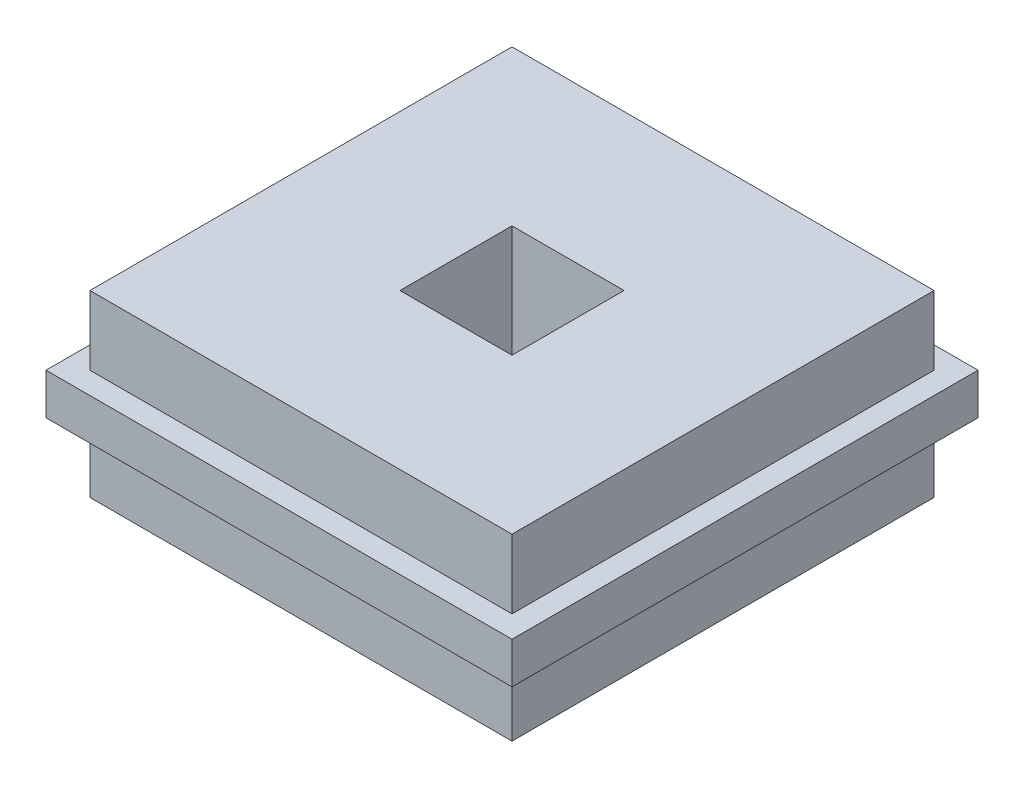
ISO-10303-21;
HEADER;
FILE_DESCRIPTION(('STEP AP214'),'2;1');
FILE_NAME('part.step','',(''),(''),'','','');
FILE_SCHEMA(('AUTOMOTIVE_DESIGN { 1 0 10303 214 1 1 1 1 }'));
ENDSEC;
DATA;
#1=APPLICATION_CONTEXT('core data for automotive mechanical design processes');
#2=APPLICATION_PROTOCOL_DEFINITION('international standard','automotive_design',2000,#1);
#3=PRODUCT_CONTEXT('',#1,'mechanical');
#4=PRODUCT('Part','Part','',(#3));
#5=PRODUCT_RELATED_PRODUCT_CATEGORY('part','',(#4));
#6=PRODUCT_DEFINITION_FORMATION('','',#4);
#7=PRODUCT_DEFINITION_CONTEXT('part definition',#1,'design');
#8=PRODUCT_DEFINITION('design','',#6,#7);
#9=PRODUCT_DEFINITION_SHAPE('','',#8);
#10=(LENGTH_UNIT() NAMED_UNIT(*) SI_UNIT(.MILLI.,.METRE.));
#11=(NAMED_UNIT(*) PLANE_ANGLE_UNIT() SI_UNIT($,.RADIAN.));
#12=(NAMED_UNIT(*) SI_UNIT($,.STERADIAN.) SOLID_ANGLE_UNIT());
#13=UNCERTAINTY_MEASURE_WITH_UNIT(LENGTH_MEASURE(1.E-05),#10,'distance_accuracy_value','');
#14=(GEOMETRIC_REPRESENTATION_CONTEXT(3) GLOBAL_UNCERTAINTY_ASSIGNED_CONTEXT((#13)) GLOBAL_UNIT_ASSIGNED_CONTEXT((#10,
#11,#12)) REPRESENTATION_CONTEXT('',''));
#15=CARTESIAN_POINT('',(0.,0.,0.));
#16=DIRECTION('',(0.,0.,1.));
#17=DIRECTION('',(1.,0.,0.));
#18=AXIS2_PLACEMENT_3D('',#15,#16,#17);
#19=CARTESIAN_POINT('',(14.95425,6.35,-14.95425));
#20=DIRECTION('',(-1.,0.,0.));
#21=DIRECTION('',(0.,0.,1.));
#22=AXIS2_PLACEMENT_3D('',#19,#20,#21);
#23=PLANE('',#22);
#24=DIRECTION('',(0.,-1.,0.));
#25=VECTOR('',#24,1.);
#26=CARTESIAN_POINT('',(14.95425,6.35,14.95425));
#27=LINE('',#26,#25);
#28=CARTESIAN_POINT('',(14.95425,6.35,14.95425));
#29=VERTEX_POINT('',#28);
#30=CARTESIAN_POINT('',(14.95425,1.4605,14.95425));
#31=VERTEX_POINT('',#30);
#32=EDGE_CURVE('E251',#29,#31,#27,.T.);
#33=ORIENTED_EDGE('',*,*,#32,.T.);
#34=DIRECTION('',(0.,0.,-1.));
#35=VECTOR('',#34,1.);
#36=CARTESIAN_POINT('',(14.95425,1.4605,-14.95425));
#37=LINE('',#36,#35);
#38=CARTESIAN_POINT('',(14.95425,1.4605,-14.95425));
#39=VERTEX_POINT('',#38);
#40=EDGE_CURVE('E226',#31,#39,#37,.T.);
#41=ORIENTED_EDGE('',*,*,#40,.T.);
#42=DIRECTION('',(0.,-1.,0.));
#43=VECTOR('',#42,1.);
#44=CARTESIAN_POINT('',(14.95425,6.35,-14.95425));
#45=LINE('',#44,#43);
#46=CARTESIAN_POINT('',(14.95425,6.35,-14.95425));
#47=VERTEX_POINT('',#46);
#48=EDGE_CURVE('E263',#47,#39,#45,.T.);
#49=ORIENTED_EDGE('',*,*,#48,.F.);
#50=DIRECTION('',(0.,0.,-1.));
#51=VECTOR('',#50,1.);
#52=CARTESIAN_POINT('',(14.95425,6.35,-14.95425));
#53=LINE('',#52,#51);
#54=EDGE_CURVE('E230',#29,#47,#53,.T.);
#55=ORIENTED_EDGE('',*,*,#54,.F.);
#56=EDGE_LOOP('',(#33,#41,#49,#55));
#57=FACE_BOUND('',#56,.T.);
#58=ADVANCED_FACE('F33',(#57),#23,.F.);
#59=CARTESIAN_POINT('',(-14.95425,6.35,-14.95425));
#60=DIRECTION('',(0.,0.,1.));
#61=DIRECTION('',(1.,0.,0.));
#62=AXIS2_PLACEMENT_3D('',#59,#60,#61);
#63=PLANE('',#62);
#64=ORIENTED_EDGE('',*,*,#48,.T.);
#65=DIRECTION('',(-1.,0.,0.));
#66=VECTOR('',#65,1.);
#67=CARTESIAN_POINT('',(-14.95425,1.4605,-14.95425));
#68=LINE('',#67,#66);
#69=CARTESIAN_POINT('',(-14.95425,1.4605,-14.95425));
#70=VERTEX_POINT('',#69);
#71=EDGE_CURVE('E223',#39,#70,#68,.T.);
#72=ORIENTED_EDGE('',*,*,#71,.T.);
#73=DIRECTION('',(0.,-1.,0.));
#74=VECTOR('',#73,1.);
#75=CARTESIAN_POINT('',(-14.95425,6.35,-14.95425));
#76=LINE('',#75,#74);
#77=CARTESIAN_POINT('',(-14.95425,6.35,-14.95425));
#78=VERTEX_POINT('',#77);
#79=EDGE_CURVE('E259',#78,#70,#76,.T.);
#80=ORIENTED_EDGE('',*,*,#79,.F.);
#81=DIRECTION('',(-1.,0.,0.));
#82=VECTOR('',#81,1.);
#83=CARTESIAN_POINT('',(-14.95425,6.35,-14.95425));
#84=LINE('',#83,#82);
#85=EDGE_CURVE('E233',#47,#78,#84,.T.);
#86=ORIENTED_EDGE('',*,*,#85,.F.);
#87=EDGE_LOOP('',(#64,#72,#80,#86));
#88=FACE_BOUND('',#87,.T.);
#89=ADVANCED_FACE('F285',(#88),#63,.F.);
#90=CARTESIAN_POINT('',(-14.95425,6.35,-14.95425));
#91=DIRECTION('',(1.,0.,0.));
#92=DIRECTION('',(0.,0.,-1.));
#93=AXIS2_PLACEMENT_3D('',#90,#91,#92);
#94=PLANE('',#93);
#95=ORIENTED_EDGE('',*,*,#79,.T.);
#96=DIRECTION('',(0.,0.,1.));
#97=VECTOR('',#96,1.);
#98=CARTESIAN_POINT('',(-14.95425,1.4605,-14.95425));
#99=LINE('',#98,#97);
#100=CARTESIAN_POINT('',(-14.95425,1.4605,14.95425));
#101=VERTEX_POINT('',#100);
#102=EDGE_CURVE('E220',#70,#101,#99,.T.);
#103=ORIENTED_EDGE('',*,*,#102,.T.);
#104=DIRECTION('',(0.,-1.,0.));
#105=VECTOR('',#104,1.);
#106=CARTESIAN_POINT('',(-14.95425,6.35,14.95425));
#107=LINE('',#106,#105);
#108=CARTESIAN_POINT('',(-14.95425,6.35,14.95425));
#109=VERTEX_POINT('',#108);
#110=EDGE_CURVE('E255',#109,#101,#107,.T.);
#111=ORIENTED_EDGE('',*,*,#110,.F.);
#112=DIRECTION('',(0.,0.,1.));
#113=VECTOR('',#112,1.);
#114=CARTESIAN_POINT('',(-14.95425,6.35,-14.95425));
#115=LINE('',#114,#113);
#116=EDGE_CURVE('E236',#78,#109,#115,.T.);
#117=ORIENTED_EDGE('',*,*,#116,.F.);
#118=EDGE_LOOP('',(#95,#103,#111,#117));
#119=FACE_BOUND('',#118,.T.);
#120=ADVANCED_FACE('F291',(#119),#94,.F.);
#121=CARTESIAN_POINT('',(-14.95425,6.35,14.95425));
#122=DIRECTION('',(0.,0.,-1.));
#123=DIRECTION('',(-1.,0.,0.));
#124=AXIS2_PLACEMENT_3D('',#121,#122,#123);
#125=PLANE('',#124);
#126=ORIENTED_EDGE('',*,*,#110,.T.);
#127=DIRECTION('',(1.,0.,0.));
#128=VECTOR('',#127,1.);
#129=CARTESIAN_POINT('',(-14.95425,1.4605,14.95425));
#130=LINE('',#129,#128);
#131=EDGE_CURVE('E11',#101,#31,#130,.T.);
#132=ORIENTED_EDGE('',*,*,#131,.T.);
#133=ORIENTED_EDGE('',*,*,#32,.F.);
#134=DIRECTION('',(1.,0.,0.));
#135=VECTOR('',#134,1.);
#136=CARTESIAN_POINT('',(-14.95425,6.35,14.95425));
#137=LINE('',#136,#135);
#138=EDGE_CURVE('E238',#109,#29,#137,.T.);
#139=ORIENTED_EDGE('',*,*,#138,.F.);
#140=EDGE_LOOP('',(#126,#132,#133,#139));
#141=FACE_BOUND('',#140,.T.);
#142=ADVANCED_FACE('F303',(#141),#125,.F.);
#143=CARTESIAN_POINT('',(0.,6.35,0.));
#144=DIRECTION('',(0.,1.,0.));
#145=DIRECTION('',(0.,0.,1.));
#146=AXIS2_PLACEMENT_3D('',#143,#144,#145);
#147=PLANE('',#146);
#148=DIRECTION('',(0.,0.,-1.));
#149=VECTOR('',#148,1.);
#150=CARTESIAN_POINT('',(3.96875,6.35,-3.96875));
#151=LINE('',#150,#149);
#152=CARTESIAN_POINT('',(3.96875,6.35,3.96875));
#153=VERTEX_POINT('',#152);
#154=CARTESIAN_POINT('',(3.96875,6.35,-3.96875));
#155=VERTEX_POINT('',#154);
#156=EDGE_CURVE('E47',#153,#155,#151,.T.);
#157=ORIENTED_EDGE('',*,*,#156,.F.);
#158=DIRECTION('',(1.,0.,0.));
#159=VECTOR('',#158,1.);
#160=CARTESIAN_POINT('',(-3.96875,6.35,3.96875));
#161=LINE('',#160,#159);
#162=CARTESIAN_POINT('',(-3.96875,6.35,3.96875));
#163=VERTEX_POINT('',#162);
#164=EDGE_CURVE('E163',#163,#153,#161,.T.);
#165=ORIENTED_EDGE('',*,*,#164,.F.);
#166=DIRECTION('',(0.,0.,1.));
#167=VECTOR('',#166,1.);
#168=CARTESIAN_POINT('',(-3.96875,6.35,-3.96875));
#169=LINE('',#168,#167);
#170=CARTESIAN_POINT('',(-3.96875,6.35,-3.96875));
#171=VERTEX_POINT('',#170);
#172=EDGE_CURVE('E166',#171,#163,#169,.T.);
#173=ORIENTED_EDGE('',*,*,#172,.F.);
#174=DIRECTION('',(-1.,0.,0.));
#175=VECTOR('',#174,1.);
#176=CARTESIAN_POINT('',(-3.96875,6.35,-3.96875));
#177=LINE('',#176,#175);
#178=EDGE_CURVE('E172',#155,#171,#177,.T.);
#179=ORIENTED_EDGE('',*,*,#178,.F.);
#180=EDGE_LOOP('',(#157,#165,#173,#179));
#181=FACE_BOUND('',#180,.T.);
#182=ORIENTED_EDGE('',*,*,#54,.T.);
#183=ORIENTED_EDGE('',*,*,#85,.T.);
#184=ORIENTED_EDGE('',*,*,#116,.T.);
#185=ORIENTED_EDGE('',*,*,#138,.T.);
#186=EDGE_LOOP('',(#182,#183,#184,#185));
#187=FACE_BOUND('',#186,.T.);
#188=ADVANCED_FACE('F311',(#181,#187),#147,.T.);
#189=CARTESIAN_POINT('',(0.,1.4605,0.));
#190=DIRECTION('',(0.,1.,0.));
#191=DIRECTION('',(0.,0.,1.));
#192=AXIS2_PLACEMENT_3D('',#189,#190,#191);
#193=PLANE('',#192);
#194=DIRECTION('',(0.,0.,1.));
#195=VECTOR('',#194,1.);
#196=CARTESIAN_POINT('',(-16.51,1.4605,16.51));
#197=LINE('',#196,#195);
#198=CARTESIAN_POINT('',(-16.51,1.4605,-16.51));
#199=VERTEX_POINT('',#198);
#200=CARTESIAN_POINT('',(-16.51,1.4605,16.51));
#201=VERTEX_POINT('',#200);
#202=EDGE_CURVE('E182',#199,#201,#197,.T.);
#203=ORIENTED_EDGE('',*,*,#202,.T.);
#204=DIRECTION('',(1.,0.,0.));
#205=VECTOR('',#204,1.);
#206=CARTESIAN_POINT('',(16.51,1.4605,16.51));
#207=LINE('',#206,#205);
#208=CARTESIAN_POINT('',(16.51,1.4605,16.51));
#209=VERTEX_POINT('',#208);
#210=EDGE_CURVE('E185',#201,#209,#207,.T.);
#211=ORIENTED_EDGE('',*,*,#210,.T.);
#212=DIRECTION('',(0.,0.,-1.));
#213=VECTOR('',#212,1.);
#214=CARTESIAN_POINT('',(16.51,1.4605,16.51));
#215=LINE('',#214,#213);
#216=CARTESIAN_POINT('',(16.51,1.4605,-16.51));
#217=VERTEX_POINT('',#216);
#218=EDGE_CURVE('E188',#209,#217,#215,.T.);
#219=ORIENTED_EDGE('',*,*,#218,.T.);
#220=DIRECTION('',(-1.,0.,0.));
#221=VECTOR('',#220,1.);
#222=CARTESIAN_POINT('',(16.51,1.4605,-16.51));
#223=LINE('',#222,#221);
#224=EDGE_CURVE('E190',#217,#199,#223,.T.);
#225=ORIENTED_EDGE('',*,*,#224,.T.);
#226=EDGE_LOOP('',(#203,#211,#219,#225));
#227=FACE_BOUND('',#226,.T.);
#228=ORIENTED_EDGE('',*,*,#40,.F.);
#229=ORIENTED_EDGE('',*,*,#131,.F.);
#230=ORIENTED_EDGE('',*,*,#102,.F.);
#231=ORIENTED_EDGE('',*,*,#71,.F.);
#232=EDGE_LOOP('',(#228,#229,#230,#231));
#233=FACE_BOUND('',#232,.T.);
#234=ADVANCED_FACE('F306',(#227,#233),#193,.T.);
#235=CARTESIAN_POINT('',(0.,-1.4605,0.));
#236=DIRECTION('',(0.,1.,0.));
#237=DIRECTION('',(0.,0.,1.));
#238=AXIS2_PLACEMENT_3D('',#235,#236,#237);
#239=PLANE('',#238);
#240=DIRECTION('',(0.,0.,1.));
#241=VECTOR('',#240,1.);
#242=CARTESIAN_POINT('',(-16.51,-1.4605,16.51));
#243=LINE('',#242,#241);
#244=CARTESIAN_POINT('',(-16.51,-1.4605,-16.51));
#245=VERTEX_POINT('',#244);
#246=CARTESIAN_POINT('',(-16.51,-1.4605,16.51));
#247=VERTEX_POINT('',#246);
#248=EDGE_CURVE('E178',#245,#247,#243,.T.);
#249=ORIENTED_EDGE('',*,*,#248,.F.);
#250=DIRECTION('',(-1.,0.,0.));
#251=VECTOR('',#250,1.);
#252=CARTESIAN_POINT('',(16.51,-1.4605,-16.51));
#253=LINE('',#252,#251);
#254=CARTESIAN_POINT('',(16.51,-1.4605,-16.51));
#255=VERTEX_POINT('',#254);
#256=EDGE_CURVE('E186',#255,#245,#253,.T.);
#257=ORIENTED_EDGE('',*,*,#256,.F.);
#258=DIRECTION('',(0.,0.,-1.));
#259=VECTOR('',#258,1.);
#260=CARTESIAN_POINT('',(16.51,-1.4605,16.51));
#261=LINE('',#260,#259);
#262=CARTESIAN_POINT('',(16.51,-1.4605,16.51));
#263=VERTEX_POINT('',#262);
#264=EDGE_CURVE('E197',#263,#255,#261,.T.);
#265=ORIENTED_EDGE('',*,*,#264,.F.);
#266=DIRECTION('',(1.,0.,0.));
#267=VECTOR('',#266,1.);
#268=CARTESIAN_POINT('',(16.51,-1.4605,16.51));
#269=LINE('',#268,#267);
#270=EDGE_CURVE('E195',#247,#263,#269,.T.);
#271=ORIENTED_EDGE('',*,*,#270,.F.);
#272=EDGE_LOOP('',(#249,#257,#265,#271));
#273=FACE_BOUND('',#272,.T.);
#274=DIRECTION('',(1.,0.,0.));
#275=VECTOR('',#274,1.);
#276=CARTESIAN_POINT('',(-14.95425,-1.4605,14.95425));
#277=LINE('',#276,#275);
#278=CARTESIAN_POINT('',(-14.95425,-1.4605,14.95425));
#279=VERTEX_POINT('',#278);
#280=CARTESIAN_POINT('',(14.95425,-1.4605,14.95425));
#281=VERTEX_POINT('',#280);
#282=EDGE_CURVE('E40',#279,#281,#277,.T.);
#283=ORIENTED_EDGE('',*,*,#282,.T.);
#284=DIRECTION('',(0.,0.,-1.));
#285=VECTOR('',#284,1.);
#286=CARTESIAN_POINT('',(14.95425,-1.4605,-14.95425));
#287=LINE('',#286,#285);
#288=CARTESIAN_POINT('',(14.95425,-1.4605,-14.95425));
#289=VERTEX_POINT('',#288);
#290=EDGE_CURVE('E217',#281,#289,#287,.T.);
#291=ORIENTED_EDGE('',*,*,#290,.T.);
#292=DIRECTION('',(-1.,0.,0.));
#293=VECTOR('',#292,1.);
#294=CARTESIAN_POINT('',(-14.95425,-1.4605,-14.95425));
#295=LINE('',#294,#293);
#296=CARTESIAN_POINT('',(-14.95425,-1.4605,-14.95425));
#297=VERTEX_POINT('',#296);
#298=EDGE_CURVE('E214',#289,#297,#295,.T.);
#299=ORIENTED_EDGE('',*,*,#298,.T.);
#300=DIRECTION('',(0.,0.,1.));
#301=VECTOR('',#300,1.);
#302=CARTESIAN_POINT('',(-14.95425,-1.4605,-14.95425));
#303=LINE('',#302,#301);
#304=EDGE_CURVE('E211',#297,#279,#303,.T.);
#305=ORIENTED_EDGE('',*,*,#304,.T.);
#306=EDGE_LOOP('',(#283,#291,#299,#305));
#307=FACE_BOUND('',#306,.T.);
#308=ADVANCED_FACE('F267',(#273,#307),#239,.F.);
#309=CARTESIAN_POINT('',(-16.51,1.4605,16.51));
#310=DIRECTION('',(1.,0.,0.));
#311=DIRECTION('',(0.,0.,-1.));
#312=AXIS2_PLACEMENT_3D('',#309,#310,#311);
#313=PLANE('',#312);
#314=ORIENTED_EDGE('',*,*,#248,.T.);
#315=DIRECTION('',(0.,-1.,0.));
#316=VECTOR('',#315,1.);
#317=CARTESIAN_POINT('',(-16.51,1.4605,16.51));
#318=LINE('',#317,#316);
#319=EDGE_CURVE('E208',#201,#247,#318,.T.);
#320=ORIENTED_EDGE('',*,*,#319,.F.);
#321=ORIENTED_EDGE('',*,*,#202,.F.);
#322=DIRECTION('',(0.,-1.,0.));
#323=VECTOR('',#322,1.);
#324=CARTESIAN_POINT('',(-16.51,1.4605,-16.51));
#325=LINE('',#324,#323);
#326=EDGE_CURVE('E192',#199,#245,#325,.T.);
#327=ORIENTED_EDGE('',*,*,#326,.T.);
#328=EDGE_LOOP('',(#314,#320,#321,#327));
#329=FACE_BOUND('',#328,.T.);
#330=ADVANCED_FACE('F324',(#329),#313,.F.);
#331=CARTESIAN_POINT('',(16.51,1.4605,16.51));
#332=DIRECTION('',(0.,0.,-1.));
#333=DIRECTION('',(-1.,0.,0.));
#334=AXIS2_PLACEMENT_3D('',#331,#332,#333);
#335=PLANE('',#334);
#336=ORIENTED_EDGE('',*,*,#270,.T.);
#337=DIRECTION('',(0.,-1.,0.));
#338=VECTOR('',#337,1.);
#339=CARTESIAN_POINT('',(16.51,1.4605,16.51));
#340=LINE('',#339,#338);
#341=EDGE_CURVE('E205',#209,#263,#340,.T.);
#342=ORIENTED_EDGE('',*,*,#341,.F.);
#343=ORIENTED_EDGE('',*,*,#210,.F.);
#344=ORIENTED_EDGE('',*,*,#319,.T.);
#345=EDGE_LOOP('',(#336,#342,#343,#344));
#346=FACE_BOUND('',#345,.T.);
#347=ADVANCED_FACE('F363',(#346),#335,.F.);
#348=CARTESIAN_POINT('',(16.51,1.4605,16.51));
#349=DIRECTION('',(-1.,0.,0.));
#350=DIRECTION('',(0.,0.,1.));
#351=AXIS2_PLACEMENT_3D('',#348,#349,#350);
#352=PLANE('',#351);
#353=ORIENTED_EDGE('',*,*,#264,.T.);
#354=DIRECTION('',(0.,-1.,0.));
#355=VECTOR('',#354,1.);
#356=CARTESIAN_POINT('',(16.51,1.4605,-16.51));
#357=LINE('',#356,#355);
#358=EDGE_CURVE('E202',#217,#255,#357,.T.);
#359=ORIENTED_EDGE('',*,*,#358,.F.);
#360=ORIENTED_EDGE('',*,*,#218,.F.);
#361=ORIENTED_EDGE('',*,*,#341,.T.);
#362=EDGE_LOOP('',(#353,#359,#360,#361));
#363=FACE_BOUND('',#362,.T.);
#364=ADVANCED_FACE('F372',(#363),#352,.F.);
#365=CARTESIAN_POINT('',(16.51,1.4605,-16.51));
#366=DIRECTION('',(0.,0.,1.));
#367=DIRECTION('',(1.,0.,0.));
#368=AXIS2_PLACEMENT_3D('',#365,#366,#367);
#369=PLANE('',#368);
#370=ORIENTED_EDGE('',*,*,#256,.T.);
#371=ORIENTED_EDGE('',*,*,#326,.F.);
#372=ORIENTED_EDGE('',*,*,#224,.F.);
#373=ORIENTED_EDGE('',*,*,#358,.T.);
#374=EDGE_LOOP('',(#370,#371,#372,#373));
#375=FACE_BOUND('',#374,.T.);
#376=ADVANCED_FACE('F327',(#375),#369,.F.);
#377=CARTESIAN_POINT('',(0.,-6.35,0.));
#378=DIRECTION('',(0.,1.,0.));
#379=DIRECTION('',(0.,0.,1.));
#380=AXIS2_PLACEMENT_3D('',#377,#378,#379);
#381=PLANE('',#380);
#382=DIRECTION('',(1.,0.,0.));
#383=VECTOR('',#382,1.);
#384=CARTESIAN_POINT('',(-3.96875,-6.35,3.96875));
#385=LINE('',#384,#383);
#386=CARTESIAN_POINT('',(-3.96875,-6.35,3.96875));
#387=VERTEX_POINT('',#386);
#388=CARTESIAN_POINT('',(3.96875,-6.35,3.96875));
#389=VERTEX_POINT('',#388);
#390=EDGE_CURVE('E153',#387,#389,#385,.T.);
#391=ORIENTED_EDGE('',*,*,#390,.T.);
#392=DIRECTION('',(0.,0.,-1.));
#393=VECTOR('',#392,1.);
#394=CARTESIAN_POINT('',(3.96875,-6.35,-3.96875));
#395=LINE('',#394,#393);
#396=CARTESIAN_POINT('',(3.96875,-6.35,-3.96875));
#397=VERTEX_POINT('',#396);
#398=EDGE_CURVE('E147',#389,#397,#395,.T.);
#399=ORIENTED_EDGE('',*,*,#398,.T.);
#400=DIRECTION('',(-1.,0.,0.));
#401=VECTOR('',#400,1.);
#402=CARTESIAN_POINT('',(-3.96875,-6.35,-3.96875));
#403=LINE('',#402,#401);
#404=CARTESIAN_POINT('',(-3.96875,-6.35,-3.96875));
#405=VERTEX_POINT('',#404);
#406=EDGE_CURVE('E156',#397,#405,#403,.T.);
#407=ORIENTED_EDGE('',*,*,#406,.T.);
#408=DIRECTION('',(0.,0.,1.));
#409=VECTOR('',#408,1.);
#410=CARTESIAN_POINT('',(-3.96875,-6.35,-3.96875));
#411=LINE('',#410,#409);
#412=EDGE_CURVE('E55',#405,#387,#411,.T.);
#413=ORIENTED_EDGE('',*,*,#412,.T.);
#414=EDGE_LOOP('',(#391,#399,#407,#413));
#415=FACE_BOUND('',#414,.T.);
#416=DIRECTION('',(0.,0.,-1.));
#417=VECTOR('',#416,1.);
#418=CARTESIAN_POINT('',(14.95425,-6.35,-14.95425));
#419=LINE('',#418,#417);
#420=CARTESIAN_POINT('',(14.95425,-6.35,14.95425));
#421=VERTEX_POINT('',#420);
#422=CARTESIAN_POINT('',(14.95425,-6.35,-14.95425));
#423=VERTEX_POINT('',#422);
#424=EDGE_CURVE('E229',#421,#423,#419,.T.);
#425=ORIENTED_EDGE('',*,*,#424,.F.);
#426=DIRECTION('',(1.,0.,0.));
#427=VECTOR('',#426,1.);
#428=CARTESIAN_POINT('',(-14.95425,-6.35,14.95425));
#429=LINE('',#428,#427);
#430=CARTESIAN_POINT('',(-14.95425,-6.35,14.95425));
#431=VERTEX_POINT('',#430);
#432=EDGE_CURVE('E234',#431,#421,#429,.T.);
#433=ORIENTED_EDGE('',*,*,#432,.F.);
#434=DIRECTION('',(0.,0.,1.));
#435=VECTOR('',#434,1.);
#436=CARTESIAN_POINT('',(-14.95425,-6.35,-14.95425));
#437=LINE('',#436,#435);
#438=CARTESIAN_POINT('',(-14.95425,-6.35,-14.95425));
#439=VERTEX_POINT('',#438);
#440=EDGE_CURVE('E246',#439,#431,#437,.T.);
#441=ORIENTED_EDGE('',*,*,#440,.F.);
#442=DIRECTION('',(-1.,0.,0.));
#443=VECTOR('',#442,1.);
#444=CARTESIAN_POINT('',(-14.95425,-6.35,-14.95425));
#445=LINE('',#444,#443);
#446=EDGE_CURVE('E243',#423,#439,#445,.T.);
#447=ORIENTED_EDGE('',*,*,#446,.F.);
#448=EDGE_LOOP('',(#425,#433,#441,#447));
#449=FACE_BOUND('',#448,.T.);
#450=ADVANCED_FACE('F160',(#415,#449),#381,.F.);
#451=ORIENTED_EDGE('',*,*,#282,.F.);
#452=EDGE_CURVE('E254',#279,#431,#107,.T.);
#453=ORIENTED_EDGE('',*,*,#452,.T.);
#454=ORIENTED_EDGE('',*,*,#432,.T.);
#455=EDGE_CURVE('E240',#281,#421,#27,.T.);
#456=ORIENTED_EDGE('',*,*,#455,.F.);
#457=EDGE_LOOP('',(#451,#453,#454,#456));
#458=FACE_BOUND('',#457,.T.);
#459=ADVANCED_FACE('F271',(#458),#125,.F.);
#460=ORIENTED_EDGE('',*,*,#304,.F.);
#461=EDGE_CURVE('E258',#297,#439,#76,.T.);
#462=ORIENTED_EDGE('',*,*,#461,.T.);
#463=ORIENTED_EDGE('',*,*,#440,.T.);
#464=ORIENTED_EDGE('',*,*,#452,.F.);
#465=EDGE_LOOP('',(#460,#462,#463,#464));
#466=FACE_BOUND('',#465,.T.);
#467=ADVANCED_FACE('F273',(#466),#94,.F.);
#468=ORIENTED_EDGE('',*,*,#298,.F.);
#469=EDGE_CURVE('E262',#289,#423,#45,.T.);
#470=ORIENTED_EDGE('',*,*,#469,.T.);
#471=ORIENTED_EDGE('',*,*,#446,.T.);
#472=ORIENTED_EDGE('',*,*,#461,.F.);
#473=EDGE_LOOP('',(#468,#470,#471,#472));
#474=FACE_BOUND('',#473,.T.);
#475=ADVANCED_FACE('F283',(#474),#63,.F.);
#476=ORIENTED_EDGE('',*,*,#290,.F.);
#477=ORIENTED_EDGE('',*,*,#455,.T.);
#478=ORIENTED_EDGE('',*,*,#424,.T.);
#479=ORIENTED_EDGE('',*,*,#469,.F.);
#480=EDGE_LOOP('',(#476,#477,#478,#479));
#481=FACE_BOUND('',#480,.T.);
#482=ADVANCED_FACE('F281',(#481),#23,.F.);
#483=CARTESIAN_POINT('',(3.96875,-6.35,-3.96875));
#484=DIRECTION('',(1.,0.,0.));
#485=DIRECTION('',(0.,0.,-1.));
#486=AXIS2_PLACEMENT_3D('',#483,#484,#485);
#487=PLANE('',#486);
#488=ORIENTED_EDGE('',*,*,#156,.T.);
#489=DIRECTION('',(0.,1.,0.));
#490=VECTOR('',#489,1.);
#491=CARTESIAN_POINT('',(3.96875,-6.35,-3.96875));
#492=LINE('',#491,#490);
#493=EDGE_CURVE('E143',#397,#155,#492,.T.);
#494=ORIENTED_EDGE('',*,*,#493,.F.);
#495=ORIENTED_EDGE('',*,*,#398,.F.);
#496=DIRECTION('',(0.,1.,0.));
#497=VECTOR('',#496,1.);
#498=CARTESIAN_POINT('',(3.96875,-6.35,3.96875));
#499=LINE('',#498,#497);
#500=EDGE_CURVE('E176',#389,#153,#499,.T.);
#501=ORIENTED_EDGE('',*,*,#500,.T.);
#502=EDGE_LOOP('',(#488,#494,#495,#501));
#503=FACE_BOUND('',#502,.T.);
#504=ADVANCED_FACE('F145',(#503),#487,.F.);
#505=CARTESIAN_POINT('',(-3.96875,-6.35,3.96875));
#506=DIRECTION('',(0.,0.,1.));
#507=DIRECTION('',(1.,0.,0.));
#508=AXIS2_PLACEMENT_3D('',#505,#506,#507);
#509=PLANE('',#508);
#510=ORIENTED_EDGE('',*,*,#164,.T.);
#511=ORIENTED_EDGE('',*,*,#500,.F.);
#512=ORIENTED_EDGE('',*,*,#390,.F.);
#513=DIRECTION('',(0.,1.,0.));
#514=VECTOR('',#513,1.);
#515=CARTESIAN_POINT('',(-3.96875,-6.35,3.96875));
#516=LINE('',#515,#514);
#517=EDGE_CURVE('E179',#387,#163,#516,.T.);
#518=ORIENTED_EDGE('',*,*,#517,.T.);
#519=EDGE_LOOP('',(#510,#511,#512,#518));
#520=FACE_BOUND('',#519,.T.);
#521=ADVANCED_FACE('F430',(#520),#509,.F.);
#522=CARTESIAN_POINT('',(-3.96875,-6.35,-3.96875));
#523=DIRECTION('',(-1.,0.,0.));
#524=DIRECTION('',(0.,0.,1.));
#525=AXIS2_PLACEMENT_3D('',#522,#523,#524);
#526=PLANE('',#525);
#527=ORIENTED_EDGE('',*,*,#172,.T.);
#528=ORIENTED_EDGE('',*,*,#517,.F.);
#529=ORIENTED_EDGE('',*,*,#412,.F.);
#530=DIRECTION('',(0.,1.,0.));
#531=VECTOR('',#530,1.);
#532=CARTESIAN_POINT('',(-3.96875,-6.35,-3.96875));
#533=LINE('',#532,#531);
#534=EDGE_CURVE('E152',#405,#171,#533,.T.);
#535=ORIENTED_EDGE('',*,*,#534,.T.);
#536=EDGE_LOOP('',(#527,#528,#529,#535));
#537=FACE_BOUND('',#536,.T.);
#538=ADVANCED_FACE('F439',(#537),#526,.F.);
#539=CARTESIAN_POINT('',(-3.96875,-6.35,-3.96875));
#540=DIRECTION('',(0.,0.,-1.));
#541=DIRECTION('',(-1.,0.,0.));
#542=AXIS2_PLACEMENT_3D('',#539,#540,#541);
#543=PLANE('',#542);
#544=ORIENTED_EDGE('',*,*,#178,.T.);
#545=ORIENTED_EDGE('',*,*,#534,.F.);
#546=ORIENTED_EDGE('',*,*,#406,.F.);
#547=ORIENTED_EDGE('',*,*,#493,.T.);
#548=EDGE_LOOP('',(#544,#545,#546,#547));
#549=FACE_BOUND('',#548,.T.);
#550=ADVANCED_FACE('F157',(#549),#543,.F.);
#551=CLOSED_SHELL('',(#58,#89,#120,#142,#188,#234,#308,#330,#347,#364,#376,#450,#459,#467,#475,
#482,#504,#521,#538,#550));
#552=MANIFOLD_SOLID_BREP('B2',#551);
#553=ADVANCED_BREP_SHAPE_REPRESENTATION('',(#18,#552),#14);
#554=SHAPE_DEFINITION_REPRESENTATION(#9,#553);
ENDSEC;
END-ISO-10303-21;
